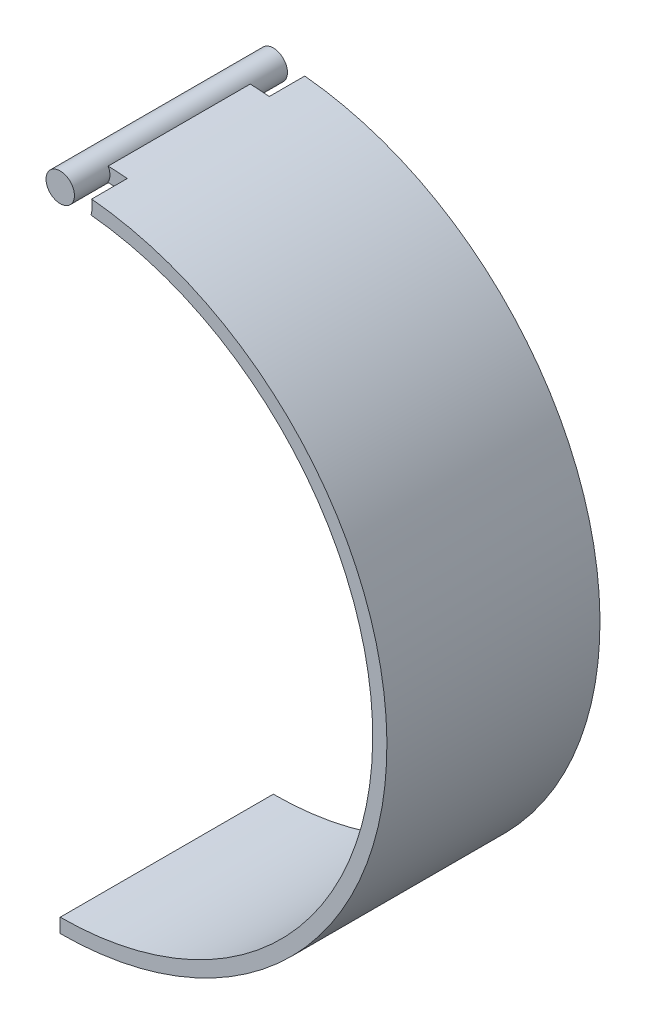
ISO-10303-21;
HEADER;
FILE_DESCRIPTION(('STEP AP214'),'2;1');
FILE_NAME('part.step','',(''),(''),'','','');
FILE_SCHEMA(('AUTOMOTIVE_DESIGN { 1 0 10303 214 1 1 1 1 }'));
ENDSEC;
DATA;
#1=APPLICATION_CONTEXT('core data for automotive mechanical design processes');
#2=APPLICATION_PROTOCOL_DEFINITION('international standard','automotive_design',2000,#1);
#3=PRODUCT_CONTEXT('',#1,'mechanical');
#4=PRODUCT('Part','Part','',(#3));
#5=PRODUCT_RELATED_PRODUCT_CATEGORY('part','',(#4));
#6=PRODUCT_DEFINITION_FORMATION('','',#4);
#7=PRODUCT_DEFINITION_CONTEXT('part definition',#1,'design');
#8=PRODUCT_DEFINITION('design','',#6,#7);
#9=PRODUCT_DEFINITION_SHAPE('','',#8);
#10=(LENGTH_UNIT() NAMED_UNIT(*) SI_UNIT(.MILLI.,.METRE.));
#11=(NAMED_UNIT(*) PLANE_ANGLE_UNIT() SI_UNIT($,.RADIAN.));
#12=(NAMED_UNIT(*) SI_UNIT($,.STERADIAN.) SOLID_ANGLE_UNIT());
#13=UNCERTAINTY_MEASURE_WITH_UNIT(LENGTH_MEASURE(1.E-05),#10,'distance_accuracy_value','');
#14=(GEOMETRIC_REPRESENTATION_CONTEXT(3) GLOBAL_UNCERTAINTY_ASSIGNED_CONTEXT((#13)) GLOBAL_UNIT_ASSIGNED_CONTEXT((#10,
#11,#12)) REPRESENTATION_CONTEXT('',''));
#15=CARTESIAN_POINT('',(0.,0.,0.));
#16=DIRECTION('',(0.,0.,1.));
#17=DIRECTION('',(1.,0.,0.));
#18=AXIS2_PLACEMENT_3D('',#15,#16,#17);
#19=CARTESIAN_POINT('',(0.,0.,0.));
#20=DIRECTION('',(0.,0.,1.));
#21=DIRECTION('',(1.,0.,0.));
#22=AXIS2_PLACEMENT_3D('',#19,#20,#21);
#23=PLANE('',#22);
#24=CARTESIAN_POINT('',(0.,0.,0.));
#25=DIRECTION('',(0.,0.,1.));
#26=DIRECTION('',(1.,0.,0.));
#27=AXIS2_PLACEMENT_3D('',#24,#25,#26);
#28=CIRCLE('',#27,1.);
#29=CARTESIAN_POINT('',(1.,0.,0.));
#30=VERTEX_POINT('',#29);
#31=EDGE_CURVE('E36',#30,#30,#28,.T.);
#32=ORIENTED_EDGE('',*,*,#31,.F.);
#33=EDGE_LOOP('',(#32));
#34=FACE_BOUND('',#33,.T.);
#35=ADVANCED_FACE('F32',(#34),#23,.F.);
#36=CARTESIAN_POINT('',(0.,0.,15.));
#37=DIRECTION('',(0.,0.,1.));
#38=DIRECTION('',(1.,0.,0.));
#39=AXIS2_PLACEMENT_3D('',#36,#37,#38);
#40=PLANE('',#39);
#41=CARTESIAN_POINT('',(0.,0.,15.));
#42=DIRECTION('',(0.,0.,1.));
#43=DIRECTION('',(1.,0.,0.));
#44=AXIS2_PLACEMENT_3D('',#41,#42,#43);
#45=CIRCLE('',#44,2.25);
#46=CARTESIAN_POINT('',(2.16659143387904,-0.606944444444445,15.));
#47=VERTEX_POINT('',#46);
#48=CARTESIAN_POINT('',(2.2154022953511,0.393055555555555,15.));
#49=VERTEX_POINT('',#48);
#50=EDGE_CURVE('E119',#47,#49,#45,.T.);
#51=ORIENTED_EDGE('',*,*,#50,.F.);
#52=CARTESIAN_POINT('',(0.,-22.5,15.));
#53=DIRECTION('',(0.,0.,-1.));
#54=DIRECTION('',(-1.,0.,0.));
#55=AXIS2_PLACEMENT_3D('',#52,#53,#54);
#56=CIRCLE('',#55,22.);
#57=CARTESIAN_POINT('',(0.,-44.5,15.));
#58=VERTEX_POINT('',#57);
#59=EDGE_CURVE('E151',#47,#58,#56,.T.);
#60=ORIENTED_EDGE('',*,*,#59,.T.);
#61=DIRECTION('',(0.,-1.,0.));
#62=VECTOR('',#61,1.);
#63=CARTESIAN_POINT('',(0.,-44.5,15.));
#64=LINE('',#63,#62);
#65=CARTESIAN_POINT('',(0.,-45.5,15.));
#66=VERTEX_POINT('',#65);
#67=EDGE_CURVE('E143',#58,#66,#64,.T.);
#68=ORIENTED_EDGE('',*,*,#67,.T.);
#69=CARTESIAN_POINT('',(0.,-22.5,15.));
#70=DIRECTION('',(0.,0.,1.));
#71=DIRECTION('',(-1.,0.,0.));
#72=AXIS2_PLACEMENT_3D('',#69,#70,#71);
#73=CIRCLE('',#72,23.);
#74=EDGE_CURVE('E139',#66,#49,#73,.T.);
#75=ORIENTED_EDGE('',*,*,#74,.T.);
#76=EDGE_LOOP('',(#51,#60,#68,#75));
#77=FACE_BOUND('',#76,.T.);
#78=ADVANCED_FACE('F166',(#77),#40,.T.);
#79=CARTESIAN_POINT('',(0.,0.,15.));
#80=DIRECTION('',(0.,0.,1.));
#81=DIRECTION('',(1.,0.,0.));
#82=AXIS2_PLACEMENT_3D('',#79,#80,#81);
#83=CIRCLE('',#82,1.);
#84=CARTESIAN_POINT('',(1.,0.,15.));
#85=VERTEX_POINT('',#84);
#86=EDGE_CURVE('E11',#85,#85,#83,.T.);
#87=ORIENTED_EDGE('',*,*,#86,.T.);
#88=EDGE_LOOP('',(#87));
#89=FACE_BOUND('',#88,.T.);
#90=ADVANCED_FACE('F171',(#89),#40,.T.);
#91=CARTESIAN_POINT('',(0.,0.,15.));
#92=DIRECTION('',(0.,0.,-1.));
#93=DIRECTION('',(-1.,0.,0.));
#94=AXIS2_PLACEMENT_3D('',#91,#92,#93);
#95=CYLINDRICAL_SURFACE('',#94,1.);
#96=ORIENTED_EDGE('',*,*,#31,.T.);
#97=EDGE_LOOP('',(#96));
#98=FACE_BOUND('',#97,.T.);
#99=CARTESIAN_POINT('',(0.,0.,12.5));
#100=DIRECTION('',(0.,0.,-1.));
#101=DIRECTION('',(-1.,0.,0.));
#102=AXIS2_PLACEMENT_3D('',#99,#100,#101);
#103=CIRCLE('',#102,1.);
#104=CARTESIAN_POINT('',(0.87543639911126,0.483333333333332,12.5));
#105=VERTEX_POINT('',#104);
#106=CARTESIAN_POINT('',(0.856186635936088,-0.516666666666665,12.5));
#107=VERTEX_POINT('',#106);
#108=EDGE_CURVE('E127',#105,#107,#103,.T.);
#109=ORIENTED_EDGE('',*,*,#108,.F.);
#110=DIRECTION('',(0.,0.,1.));
#111=VECTOR('',#110,1.);
#112=CARTESIAN_POINT('',(0.87543639911126,0.483333333333332,7.5));
#113=LINE('',#112,#111);
#114=CARTESIAN_POINT('',(0.87543639911126,0.483333333333332,2.5));
#115=VERTEX_POINT('',#114);
#116=EDGE_CURVE('E160',#105,#115,#113,.F.);
#117=ORIENTED_EDGE('',*,*,#116,.T.);
#118=CARTESIAN_POINT('',(0.,0.,2.5));
#119=DIRECTION('',(0.,0.,1.));
#120=DIRECTION('',(-1.,0.,0.));
#121=AXIS2_PLACEMENT_3D('',#118,#119,#120);
#122=CIRCLE('',#121,1.);
#123=CARTESIAN_POINT('',(0.856186635936089,-0.516666666666665,2.5));
#124=VERTEX_POINT('',#123);
#125=EDGE_CURVE('E108',#124,#115,#122,.T.);
#126=ORIENTED_EDGE('',*,*,#125,.F.);
#127=DIRECTION('',(0.,0.,1.));
#128=VECTOR('',#127,1.);
#129=CARTESIAN_POINT('',(0.856186635936088,-0.516666666666665,7.5));
#130=LINE('',#129,#128);
#131=EDGE_CURVE('E55',#124,#107,#130,.T.);
#132=ORIENTED_EDGE('',*,*,#131,.T.);
#133=EDGE_LOOP('',(#109,#117,#126,#132));
#134=FACE_BOUND('',#133,.T.);
#135=ORIENTED_EDGE('',*,*,#86,.F.);
#136=EDGE_LOOP('',(#135));
#137=FACE_BOUND('',#136,.T.);
#138=ADVANCED_FACE('F34',(#98,#134,#137),#95,.T.);
#139=CARTESIAN_POINT('',(0.,-22.5,0.));
#140=DIRECTION('',(0.,0.,-1.));
#141=DIRECTION('',(-1.,0.,0.));
#142=AXIS2_PLACEMENT_3D('',#139,#140,#141);
#143=CIRCLE('',#142,22.);
#144=CARTESIAN_POINT('',(2.16659143387903,-0.606944444444445,0.));
#145=VERTEX_POINT('',#144);
#146=CARTESIAN_POINT('',(0.,-44.5,0.));
#147=VERTEX_POINT('',#146);
#148=EDGE_CURVE('E142',#145,#147,#143,.T.);
#149=ORIENTED_EDGE('',*,*,#148,.F.);
#150=CARTESIAN_POINT('',(0.,0.,0.));
#151=DIRECTION('',(0.,0.,-1.));
#152=DIRECTION('',(-1.,0.,0.));
#153=AXIS2_PLACEMENT_3D('',#150,#151,#152);
#154=CIRCLE('',#153,2.25);
#155=CARTESIAN_POINT('',(2.2154022953511,0.393055555555552,0.));
#156=VERTEX_POINT('',#155);
#157=EDGE_CURVE('E112',#156,#145,#154,.T.);
#158=ORIENTED_EDGE('',*,*,#157,.F.);
#159=CARTESIAN_POINT('',(0.,-22.5,0.));
#160=DIRECTION('',(0.,0.,1.));
#161=DIRECTION('',(-1.,0.,0.));
#162=AXIS2_PLACEMENT_3D('',#159,#160,#161);
#163=CIRCLE('',#162,23.);
#164=CARTESIAN_POINT('',(0.,-45.5,0.));
#165=VERTEX_POINT('',#164);
#166=EDGE_CURVE('E117',#165,#156,#163,.T.);
#167=ORIENTED_EDGE('',*,*,#166,.F.);
#168=DIRECTION('',(0.,-1.,0.));
#169=VECTOR('',#168,1.);
#170=CARTESIAN_POINT('',(0.,-44.5,0.));
#171=LINE('',#170,#169);
#172=EDGE_CURVE('E145',#147,#165,#171,.T.);
#173=ORIENTED_EDGE('',*,*,#172,.F.);
#174=EDGE_LOOP('',(#149,#158,#167,#173));
#175=FACE_BOUND('',#174,.T.);
#176=ADVANCED_FACE('F167',(#175),#23,.F.);
#177=CARTESIAN_POINT('',(0.,-22.5,0.));
#178=DIRECTION('',(0.,0.,1.));
#179=DIRECTION('',(1.,0.,0.));
#180=AXIS2_PLACEMENT_3D('',#177,#178,#179);
#181=CYLINDRICAL_SURFACE('',#180,23.);
#182=DIRECTION('',(0.,0.,-1.));
#183=VECTOR('',#182,1.);
#184=CARTESIAN_POINT('',(2.2154022953511,0.393055555555552,2.5));
#185=LINE('',#184,#183);
#186=CARTESIAN_POINT('',(2.2154022953511,0.393055555555552,2.5));
#187=VERTEX_POINT('',#186);
#188=EDGE_CURVE('E98',#187,#156,#185,.T.);
#189=ORIENTED_EDGE('',*,*,#188,.F.);
#190=CARTESIAN_POINT('',(0.,-22.5,2.5));
#191=DIRECTION('',(0.,0.,-1.));
#192=DIRECTION('',(-1.,0.,0.));
#193=AXIS2_PLACEMENT_3D('',#190,#191,#192);
#194=CIRCLE('',#193,23.);
#195=EDGE_CURVE('E104',#115,#187,#194,.T.);
#196=ORIENTED_EDGE('',*,*,#195,.F.);
#197=ORIENTED_EDGE('',*,*,#116,.F.);
#198=CARTESIAN_POINT('',(0.,-22.5,12.5));
#199=DIRECTION('',(0.,0.,1.));
#200=DIRECTION('',(-1.,0.,0.));
#201=AXIS2_PLACEMENT_3D('',#198,#199,#200);
#202=CIRCLE('',#201,23.);
#203=CARTESIAN_POINT('',(2.2154022953511,0.393055555555555,12.5));
#204=VERTEX_POINT('',#203);
#205=EDGE_CURVE('E124',#204,#105,#202,.T.);
#206=ORIENTED_EDGE('',*,*,#205,.F.);
#207=DIRECTION('',(0.,0.,1.));
#208=VECTOR('',#207,1.);
#209=CARTESIAN_POINT('',(2.2154022953511,0.393055555555555,12.5));
#210=LINE('',#209,#208);
#211=EDGE_CURVE('E136',#204,#49,#210,.T.);
#212=ORIENTED_EDGE('',*,*,#211,.T.);
#213=ORIENTED_EDGE('',*,*,#74,.F.);
#214=DIRECTION('',(0.,0.,1.));
#215=VECTOR('',#214,1.);
#216=CARTESIAN_POINT('',(0.,-45.5,0.));
#217=LINE('',#216,#215);
#218=EDGE_CURVE('E155',#165,#66,#217,.T.);
#219=ORIENTED_EDGE('',*,*,#218,.F.);
#220=ORIENTED_EDGE('',*,*,#166,.T.);
#221=EDGE_LOOP('',(#189,#196,#197,#206,#212,#213,#219,#220));
#222=FACE_BOUND('',#221,.T.);
#223=ADVANCED_FACE('F115',(#222),#181,.T.);
#224=CARTESIAN_POINT('',(0.,-22.5,0.));
#225=DIRECTION('',(0.,0.,1.));
#226=DIRECTION('',(1.,0.,0.));
#227=AXIS2_PLACEMENT_3D('',#224,#225,#226);
#228=CYLINDRICAL_SURFACE('',#227,22.);
#229=DIRECTION('',(0.,0.,-1.));
#230=VECTOR('',#229,1.);
#231=CARTESIAN_POINT('',(2.16659143387903,-0.606944444444445,2.5));
#232=LINE('',#231,#230);
#233=CARTESIAN_POINT('',(2.16659143387903,-0.606944444444445,2.5));
#234=VERTEX_POINT('',#233);
#235=EDGE_CURVE('E101',#234,#145,#232,.T.);
#236=ORIENTED_EDGE('',*,*,#235,.T.);
#237=ORIENTED_EDGE('',*,*,#148,.T.);
#238=DIRECTION('',(0.,0.,1.));
#239=VECTOR('',#238,1.);
#240=CARTESIAN_POINT('',(0.,-44.5,0.));
#241=LINE('',#240,#239);
#242=EDGE_CURVE('E148',#147,#58,#241,.T.);
#243=ORIENTED_EDGE('',*,*,#242,.T.);
#244=ORIENTED_EDGE('',*,*,#59,.F.);
#245=DIRECTION('',(0.,0.,1.));
#246=VECTOR('',#245,1.);
#247=CARTESIAN_POINT('',(2.16659143387904,-0.606944444444445,12.5));
#248=LINE('',#247,#246);
#249=CARTESIAN_POINT('',(2.16659143387904,-0.606944444444445,12.5));
#250=VERTEX_POINT('',#249);
#251=EDGE_CURVE('E134',#250,#47,#248,.T.);
#252=ORIENTED_EDGE('',*,*,#251,.F.);
#253=CARTESIAN_POINT('',(0.,-22.5,12.5));
#254=DIRECTION('',(0.,0.,-1.));
#255=DIRECTION('',(-1.,0.,0.));
#256=AXIS2_PLACEMENT_3D('',#253,#254,#255);
#257=CIRCLE('',#256,22.);
#258=EDGE_CURVE('E129',#107,#250,#257,.T.);
#259=ORIENTED_EDGE('',*,*,#258,.F.);
#260=ORIENTED_EDGE('',*,*,#131,.F.);
#261=CARTESIAN_POINT('',(0.,-22.5,2.5));
#262=DIRECTION('',(0.,0.,1.));
#263=DIRECTION('',(1.,0.,0.));
#264=AXIS2_PLACEMENT_3D('',#261,#262,#263);
#265=CIRCLE('',#264,22.);
#266=EDGE_CURVE('E103',#234,#124,#265,.T.);
#267=ORIENTED_EDGE('',*,*,#266,.F.);
#268=EDGE_LOOP('',(#236,#237,#243,#244,#252,#259,#260,#267));
#269=FACE_BOUND('',#268,.T.);
#270=ADVANCED_FACE('F180',(#269),#228,.F.);
#271=CARTESIAN_POINT('',(0.,-44.5,0.));
#272=DIRECTION('',(-1.,0.,0.));
#273=DIRECTION('',(0.,-1.,0.));
#274=AXIS2_PLACEMENT_3D('',#271,#272,#273);
#275=PLANE('',#274);
#276=ORIENTED_EDGE('',*,*,#67,.F.);
#277=ORIENTED_EDGE('',*,*,#242,.F.);
#278=ORIENTED_EDGE('',*,*,#172,.T.);
#279=ORIENTED_EDGE('',*,*,#218,.T.);
#280=EDGE_LOOP('',(#276,#277,#278,#279));
#281=FACE_BOUND('',#280,.T.);
#282=ADVANCED_FACE('F189',(#281),#275,.T.);
#283=CARTESIAN_POINT('',(0.,0.,12.5));
#284=DIRECTION('',(0.,0.,1.));
#285=DIRECTION('',(1.,0.,0.));
#286=AXIS2_PLACEMENT_3D('',#283,#284,#285);
#287=CYLINDRICAL_SURFACE('',#286,2.25);
#288=ORIENTED_EDGE('',*,*,#50,.T.);
#289=ORIENTED_EDGE('',*,*,#211,.F.);
#290=CARTESIAN_POINT('',(0.,0.,12.5));
#291=DIRECTION('',(0.,0.,1.));
#292=DIRECTION('',(1.,0.,0.));
#293=AXIS2_PLACEMENT_3D('',#290,#291,#292);
#294=CIRCLE('',#293,2.25);
#295=EDGE_CURVE('E131',#250,#204,#294,.T.);
#296=ORIENTED_EDGE('',*,*,#295,.F.);
#297=ORIENTED_EDGE('',*,*,#251,.T.);
#298=EDGE_LOOP('',(#288,#289,#296,#297));
#299=FACE_BOUND('',#298,.T.);
#300=ADVANCED_FACE('F196',(#299),#287,.F.);
#301=CARTESIAN_POINT('',(0.,-11.25,12.5));
#302=DIRECTION('',(0.,0.,-1.));
#303=DIRECTION('',(-1.,0.,0.));
#304=AXIS2_PLACEMENT_3D('',#301,#302,#303);
#305=PLANE('',#304);
#306=ORIENTED_EDGE('',*,*,#205,.T.);
#307=ORIENTED_EDGE('',*,*,#108,.T.);
#308=ORIENTED_EDGE('',*,*,#258,.T.);
#309=ORIENTED_EDGE('',*,*,#295,.T.);
#310=EDGE_LOOP('',(#306,#307,#308,#309));
#311=FACE_BOUND('',#310,.T.);
#312=ADVANCED_FACE('F199',(#311),#305,.F.);
#313=CARTESIAN_POINT('',(0.,0.,2.5));
#314=DIRECTION('',(0.,0.,-1.));
#315=DIRECTION('',(-1.,0.,0.));
#316=AXIS2_PLACEMENT_3D('',#313,#314,#315);
#317=CYLINDRICAL_SURFACE('',#316,2.25);
#318=ORIENTED_EDGE('',*,*,#157,.T.);
#319=ORIENTED_EDGE('',*,*,#235,.F.);
#320=CARTESIAN_POINT('',(0.,0.,2.5));
#321=DIRECTION('',(0.,0.,-1.));
#322=DIRECTION('',(-1.,0.,0.));
#323=AXIS2_PLACEMENT_3D('',#320,#321,#322);
#324=CIRCLE('',#323,2.25);
#325=EDGE_CURVE('E47',#187,#234,#324,.T.);
#326=ORIENTED_EDGE('',*,*,#325,.F.);
#327=ORIENTED_EDGE('',*,*,#188,.T.);
#328=EDGE_LOOP('',(#318,#319,#326,#327));
#329=FACE_BOUND('',#328,.T.);
#330=ADVANCED_FACE('F96',(#329),#317,.F.);
#331=CARTESIAN_POINT('',(0.,-11.25,2.5));
#332=DIRECTION('',(0.,0.,-1.));
#333=DIRECTION('',(-1.,0.,0.));
#334=AXIS2_PLACEMENT_3D('',#331,#332,#333);
#335=PLANE('',#334);
#336=ORIENTED_EDGE('',*,*,#195,.T.);
#337=ORIENTED_EDGE('',*,*,#325,.T.);
#338=ORIENTED_EDGE('',*,*,#266,.T.);
#339=ORIENTED_EDGE('',*,*,#125,.T.);
#340=EDGE_LOOP('',(#336,#337,#338,#339));
#341=FACE_BOUND('',#340,.T.);
#342=ADVANCED_FACE('F107',(#341),#335,.T.);
#343=CLOSED_SHELL('',(#35,#78,#90,#138,#176,#223,#270,#282,#300,#312,#330,#342));
#344=MANIFOLD_SOLID_BREP('B2',#343);
#345=ADVANCED_BREP_SHAPE_REPRESENTATION('',(#18,#344),#14);
#346=SHAPE_DEFINITION_REPRESENTATION(#9,#345);
ENDSEC;
END-ISO-10303-21;
